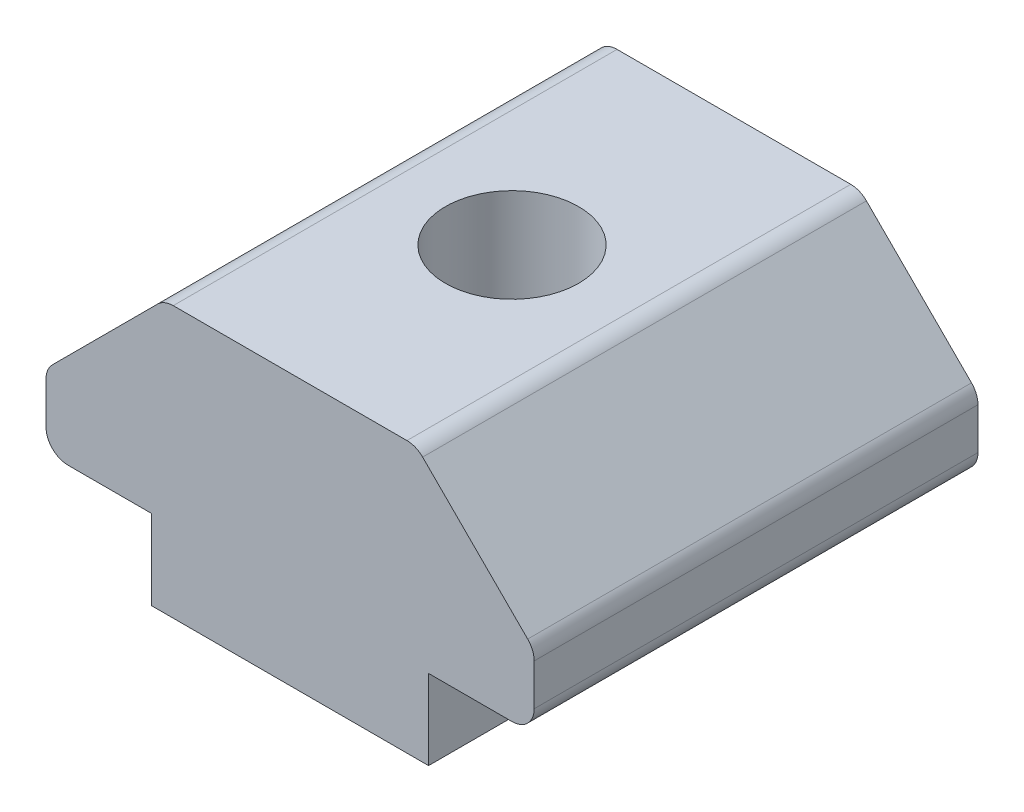
ISO-10303-21;
HEADER;
FILE_DESCRIPTION(('STEP AP214'),'2;1');
FILE_NAME('part.step','',(''),(''),'','','');
FILE_SCHEMA(('AUTOMOTIVE_DESIGN { 1 0 10303 214 1 1 1 1 }'));
ENDSEC;
DATA;
#1=APPLICATION_CONTEXT('core data for automotive mechanical design processes');
#2=APPLICATION_PROTOCOL_DEFINITION('international standard','automotive_design',2000,#1);
#3=PRODUCT_CONTEXT('',#1,'mechanical');
#4=PRODUCT('Part','Part','',(#3));
#5=PRODUCT_RELATED_PRODUCT_CATEGORY('part','',(#4));
#6=PRODUCT_DEFINITION_FORMATION('','',#4);
#7=PRODUCT_DEFINITION_CONTEXT('part definition',#1,'design');
#8=PRODUCT_DEFINITION('design','',#6,#7);
#9=PRODUCT_DEFINITION_SHAPE('','',#8);
#10=(LENGTH_UNIT() NAMED_UNIT(*) SI_UNIT(.MILLI.,.METRE.));
#11=(NAMED_UNIT(*) PLANE_ANGLE_UNIT() SI_UNIT($,.RADIAN.));
#12=(NAMED_UNIT(*) SI_UNIT($,.STERADIAN.) SOLID_ANGLE_UNIT());
#13=UNCERTAINTY_MEASURE_WITH_UNIT(LENGTH_MEASURE(1.E-05),#10,'distance_accuracy_value','');
#14=(GEOMETRIC_REPRESENTATION_CONTEXT(3) GLOBAL_UNCERTAINTY_ASSIGNED_CONTEXT((#13)) GLOBAL_UNIT_ASSIGNED_CONTEXT((#10,
#11,#12)) REPRESENTATION_CONTEXT('',''));
#15=CARTESIAN_POINT('',(0.,0.,0.));
#16=DIRECTION('',(0.,0.,1.));
#17=DIRECTION('',(1.,0.,0.));
#18=AXIS2_PLACEMENT_3D('',#15,#16,#17);
#19=CARTESIAN_POINT('',(-15.5,1.79933982822017,10.));
#20=DIRECTION('',(0.,1.,0.));
#21=DIRECTION('',(-1.,0.,0.));
#22=AXIS2_PLACEMENT_3D('',#19,#20,#21);
#23=PLANE('',#22);
#24=DIRECTION('',(1.,0.,0.));
#25=VECTOR('',#24,1.);
#26=CARTESIAN_POINT('',(-15.5,1.79933982822017,0.));
#27=LINE('',#26,#25);
#28=CARTESIAN_POINT('',(-15.,1.79933982822017,0.));
#29=VERTEX_POINT('',#28);
#30=CARTESIAN_POINT('',(-13.12,1.79933982822017,0.));
#31=VERTEX_POINT('',#30);
#32=EDGE_CURVE('E207',#29,#31,#27,.T.);
#33=ORIENTED_EDGE('',*,*,#32,.T.);
#34=DIRECTION('',(0.,0.,1.));
#35=VECTOR('',#34,1.);
#36=CARTESIAN_POINT('',(-13.12,1.79933982822017,0.));
#37=LINE('',#36,#35);
#38=CARTESIAN_POINT('',(-13.12,1.79933982822017,10.));
#39=VERTEX_POINT('',#38);
#40=EDGE_CURVE('E58',#31,#39,#37,.T.);
#41=ORIENTED_EDGE('',*,*,#40,.T.);
#42=DIRECTION('',(1.,0.,0.));
#43=VECTOR('',#42,1.);
#44=CARTESIAN_POINT('',(-15.5,1.79933982822017,10.));
#45=LINE('',#44,#43);
#46=CARTESIAN_POINT('',(-15.,1.79933982822017,10.));
#47=VERTEX_POINT('',#46);
#48=EDGE_CURVE('E190',#47,#39,#45,.T.);
#49=ORIENTED_EDGE('',*,*,#48,.F.);
#50=DIRECTION('',(0.,0.,-1.));
#51=VECTOR('',#50,1.);
#52=CARTESIAN_POINT('',(-15.,1.79933982822017,10.));
#53=LINE('',#52,#51);
#54=EDGE_CURVE('E206',#47,#29,#53,.T.);
#55=ORIENTED_EDGE('',*,*,#54,.T.);
#56=EDGE_LOOP('',(#33,#41,#49,#55));
#57=FACE_BOUND('',#56,.T.);
#58=ADVANCED_FACE('F36',(#57),#23,.F.);
#59=CARTESIAN_POINT('',(-6.88,1.79933982822017,10.));
#60=VERTEX_POINT('',#59);
#61=CARTESIAN_POINT('',(-5.,1.79933982822017,10.));
#62=VERTEX_POINT('',#61);
#63=EDGE_CURVE('E50',#60,#62,#45,.T.);
#64=ORIENTED_EDGE('',*,*,#63,.F.);
#65=DIRECTION('',(0.,0.,1.));
#66=VECTOR('',#65,1.);
#67=CARTESIAN_POINT('',(-6.88,1.79933982822017,0.));
#68=LINE('',#67,#66);
#69=CARTESIAN_POINT('',(-6.88,1.79933982822017,0.));
#70=VERTEX_POINT('',#69);
#71=EDGE_CURVE('E160',#70,#60,#68,.T.);
#72=ORIENTED_EDGE('',*,*,#71,.F.);
#73=CARTESIAN_POINT('',(-5.,1.79933982822017,0.));
#74=VERTEX_POINT('',#73);
#75=EDGE_CURVE('E171',#70,#74,#27,.T.);
#76=ORIENTED_EDGE('',*,*,#75,.T.);
#77=DIRECTION('',(0.,0.,-1.));
#78=VECTOR('',#77,1.);
#79=CARTESIAN_POINT('',(-5.,1.79933982822017,10.));
#80=LINE('',#79,#78);
#81=EDGE_CURVE('E12',#74,#62,#80,.F.);
#82=ORIENTED_EDGE('',*,*,#81,.T.);
#83=EDGE_LOOP('',(#64,#72,#76,#82));
#84=FACE_BOUND('',#83,.T.);
#85=ADVANCED_FACE('F326',(#84),#23,.F.);
#86=CARTESIAN_POINT('',(-4.5,1.79933982822017,10.));
#87=DIRECTION('',(-1.,0.,0.));
#88=DIRECTION('',(0.,-1.,0.));
#89=AXIS2_PLACEMENT_3D('',#86,#87,#88);
#90=PLANE('',#89);
#91=DIRECTION('',(0.,1.,0.));
#92=VECTOR('',#91,1.);
#93=CARTESIAN_POINT('',(-4.5,1.79933982822017,0.));
#94=LINE('',#93,#92);
#95=CARTESIAN_POINT('',(-4.5,2.29933982822017,0.));
#96=VERTEX_POINT('',#95);
#97=CARTESIAN_POINT('',(-4.5,3.23223304703362,0.));
#98=VERTEX_POINT('',#97);
#99=EDGE_CURVE('E209',#96,#98,#94,.T.);
#100=ORIENTED_EDGE('',*,*,#99,.T.);
#101=DIRECTION('',(0.,0.,-1.));
#102=VECTOR('',#101,1.);
#103=CARTESIAN_POINT('',(-4.5,3.23223304703362,10.));
#104=LINE('',#103,#102);
#105=CARTESIAN_POINT('',(-4.5,3.23223304703362,10.));
#106=VERTEX_POINT('',#105);
#107=EDGE_CURVE('E44',#98,#106,#104,.F.);
#108=ORIENTED_EDGE('',*,*,#107,.T.);
#109=DIRECTION('',(0.,1.,0.));
#110=VECTOR('',#109,1.);
#111=CARTESIAN_POINT('',(-4.5,1.79933982822017,10.));
#112=LINE('',#111,#110);
#113=CARTESIAN_POINT('',(-4.5,2.29933982822017,10.));
#114=VERTEX_POINT('',#113);
#115=EDGE_CURVE('E192',#114,#106,#112,.T.);
#116=ORIENTED_EDGE('',*,*,#115,.F.);
#117=DIRECTION('',(0.,0.,-1.));
#118=VECTOR('',#117,1.);
#119=CARTESIAN_POINT('',(-4.5,2.29933982822017,10.));
#120=LINE('',#119,#118);
#121=EDGE_CURVE('E271',#114,#96,#120,.T.);
#122=ORIENTED_EDGE('',*,*,#121,.T.);
#123=EDGE_LOOP('',(#100,#108,#116,#122));
#124=FACE_BOUND('',#123,.T.);
#125=ADVANCED_FACE('F276',(#124),#90,.F.);
#126=CARTESIAN_POINT('',(-4.5,3.43933982822017,10.));
#127=DIRECTION('',(-0.707106781186547,-0.707106781186548,0.));
#128=DIRECTION('',(0.707106781186548,-0.707106781186547,0.));
#129=AXIS2_PLACEMENT_3D('',#126,#127,#128);
#130=PLANE('',#129);
#131=DIRECTION('',(-0.707106781186548,0.707106781186547,0.));
#132=VECTOR('',#131,1.);
#133=CARTESIAN_POINT('',(-4.5,3.43933982822017,0.));
#134=LINE('',#133,#132);
#135=CARTESIAN_POINT('',(-4.64644660940673,3.5857864376269,0.));
#136=VERTEX_POINT('',#135);
#137=CARTESIAN_POINT('',(-7.01355339059328,5.95289321881345,0.));
#138=VERTEX_POINT('',#137);
#139=EDGE_CURVE('E212',#136,#138,#134,.T.);
#140=ORIENTED_EDGE('',*,*,#139,.T.);
#141=DIRECTION('',(0.,0.,-1.));
#142=VECTOR('',#141,1.);
#143=CARTESIAN_POINT('',(-7.01355339059328,5.95289321881344,10.));
#144=LINE('',#143,#142);
#145=CARTESIAN_POINT('',(-7.01355339059328,5.95289321881345,10.));
#146=VERTEX_POINT('',#145);
#147=EDGE_CURVE('E269',#138,#146,#144,.F.);
#148=ORIENTED_EDGE('',*,*,#147,.T.);
#149=DIRECTION('',(-0.707106781186548,0.707106781186547,0.));
#150=VECTOR('',#149,1.);
#151=CARTESIAN_POINT('',(-4.5,3.43933982822017,10.));
#152=LINE('',#151,#150);
#153=CARTESIAN_POINT('',(-4.64644660940673,3.5857864376269,10.));
#154=VERTEX_POINT('',#153);
#155=EDGE_CURVE('E195',#154,#146,#152,.T.);
#156=ORIENTED_EDGE('',*,*,#155,.F.);
#157=DIRECTION('',(0.,0.,-1.));
#158=VECTOR('',#157,1.);
#159=CARTESIAN_POINT('',(-4.64644660940673,3.5857864376269,10.));
#160=LINE('',#159,#158);
#161=EDGE_CURVE('E266',#154,#136,#160,.T.);
#162=ORIENTED_EDGE('',*,*,#161,.T.);
#163=EDGE_LOOP('',(#140,#148,#156,#162));
#164=FACE_BOUND('',#163,.T.);
#165=ADVANCED_FACE('F289',(#164),#130,.F.);
#166=CARTESIAN_POINT('',(-9.75,6.09933982822017,10.));
#167=DIRECTION('',(0.,-1.,0.));
#168=DIRECTION('',(0.,0.,-1.));
#169=AXIS2_PLACEMENT_3D('',#166,#167,#168);
#170=PLANE('',#169);
#171=CARTESIAN_POINT('',(-10.,6.09933982822018,5.));
#172=DIRECTION('',(0.,-1.,0.));
#173=DIRECTION('',(1.,0.,0.));
#174=AXIS2_PLACEMENT_3D('',#171,#172,#173);
#175=CIRCLE('',#174,1.5);
#176=CARTESIAN_POINT('',(-8.5,6.09933982822018,5.));
#177=VERTEX_POINT('',#176);
#178=EDGE_CURVE('E180',#177,#177,#175,.T.);
#179=ORIENTED_EDGE('',*,*,#178,.T.);
#180=EDGE_LOOP('',(#179));
#181=FACE_BOUND('',#180,.T.);
#182=DIRECTION('',(-1.,0.,0.));
#183=VECTOR('',#182,1.);
#184=CARTESIAN_POINT('',(-9.75,6.09933982822017,0.));
#185=LINE('',#184,#183);
#186=CARTESIAN_POINT('',(-7.36710678118655,6.09933982822017,0.));
#187=VERTEX_POINT('',#186);
#188=CARTESIAN_POINT('',(-12.6328932188135,6.09933982822017,0.));
#189=VERTEX_POINT('',#188);
#190=EDGE_CURVE('E215',#187,#189,#185,.T.);
#191=ORIENTED_EDGE('',*,*,#190,.T.);
#192=DIRECTION('',(0.,0.,-1.));
#193=VECTOR('',#192,1.);
#194=CARTESIAN_POINT('',(-12.6328932188135,6.09933982822017,10.));
#195=LINE('',#194,#193);
#196=CARTESIAN_POINT('',(-12.6328932188135,6.09933982822018,10.));
#197=VERTEX_POINT('',#196);
#198=EDGE_CURVE('E264',#189,#197,#195,.F.);
#199=ORIENTED_EDGE('',*,*,#198,.T.);
#200=DIRECTION('',(-1.,0.,0.));
#201=VECTOR('',#200,1.);
#202=CARTESIAN_POINT('',(-7.16,6.09933982822017,10.));
#203=LINE('',#202,#201);
#204=CARTESIAN_POINT('',(-7.36710678118655,6.09933982822017,10.));
#205=VERTEX_POINT('',#204);
#206=EDGE_CURVE('E198',#205,#197,#203,.T.);
#207=ORIENTED_EDGE('',*,*,#206,.F.);
#208=DIRECTION('',(0.,0.,-1.));
#209=VECTOR('',#208,1.);
#210=CARTESIAN_POINT('',(-7.36710678118655,6.09933982822017,10.));
#211=LINE('',#210,#209);
#212=EDGE_CURVE('E261',#205,#187,#211,.T.);
#213=ORIENTED_EDGE('',*,*,#212,.T.);
#214=EDGE_LOOP('',(#191,#199,#207,#213));
#215=FACE_BOUND('',#214,.T.);
#216=ADVANCED_FACE('F298',(#181,#215),#170,.F.);
#217=CARTESIAN_POINT('',(-12.84,6.09933982822017,10.));
#218=DIRECTION('',(0.707106781186547,-0.707106781186548,0.));
#219=DIRECTION('',(0.707106781186548,0.707106781186547,0.));
#220=AXIS2_PLACEMENT_3D('',#217,#218,#219);
#221=PLANE('',#220);
#222=DIRECTION('',(-0.707106781186548,-0.707106781186547,0.));
#223=VECTOR('',#222,1.);
#224=CARTESIAN_POINT('',(-12.84,6.09933982822017,0.));
#225=LINE('',#224,#223);
#226=CARTESIAN_POINT('',(-12.9864466094067,5.95289321881344,0.));
#227=VERTEX_POINT('',#226);
#228=CARTESIAN_POINT('',(-15.3535533905933,3.5857864376269,0.));
#229=VERTEX_POINT('',#228);
#230=EDGE_CURVE('E218',#227,#229,#225,.T.);
#231=ORIENTED_EDGE('',*,*,#230,.T.);
#232=DIRECTION('',(0.,0.,-1.));
#233=VECTOR('',#232,1.);
#234=CARTESIAN_POINT('',(-15.3535533905933,3.5857864376269,10.));
#235=LINE('',#234,#233);
#236=CARTESIAN_POINT('',(-15.3535533905933,3.5857864376269,10.));
#237=VERTEX_POINT('',#236);
#238=EDGE_CURVE('E249',#229,#237,#235,.F.);
#239=ORIENTED_EDGE('',*,*,#238,.T.);
#240=DIRECTION('',(-0.707106781186548,-0.707106781186547,0.));
#241=VECTOR('',#240,1.);
#242=CARTESIAN_POINT('',(-12.84,6.09933982822017,10.));
#243=LINE('',#242,#241);
#244=CARTESIAN_POINT('',(-12.9864466094067,5.95289321881344,10.));
#245=VERTEX_POINT('',#244);
#246=EDGE_CURVE('E201',#245,#237,#243,.T.);
#247=ORIENTED_EDGE('',*,*,#246,.F.);
#248=DIRECTION('',(0.,0.,-1.));
#249=VECTOR('',#248,1.);
#250=CARTESIAN_POINT('',(-12.9864466094067,5.95289321881344,10.));
#251=LINE('',#250,#249);
#252=EDGE_CURVE('E246',#245,#227,#251,.T.);
#253=ORIENTED_EDGE('',*,*,#252,.T.);
#254=EDGE_LOOP('',(#231,#239,#247,#253));
#255=FACE_BOUND('',#254,.T.);
#256=ADVANCED_FACE('F307',(#255),#221,.F.);
#257=CARTESIAN_POINT('',(-15.5,3.43933982822018,10.));
#258=DIRECTION('',(1.,0.,0.));
#259=DIRECTION('',(0.,0.,-1.));
#260=AXIS2_PLACEMENT_3D('',#257,#258,#259);
#261=PLANE('',#260);
#262=DIRECTION('',(0.,-1.,0.));
#263=VECTOR('',#262,1.);
#264=CARTESIAN_POINT('',(-15.5,3.43933982822018,10.));
#265=LINE('',#264,#263);
#266=CARTESIAN_POINT('',(-15.5,3.23223304703363,10.));
#267=VERTEX_POINT('',#266);
#268=CARTESIAN_POINT('',(-15.5,2.29933982822017,10.));
#269=VERTEX_POINT('',#268);
#270=EDGE_CURVE('E204',#267,#269,#265,.T.);
#271=ORIENTED_EDGE('',*,*,#270,.F.);
#272=DIRECTION('',(0.,0.,-1.));
#273=VECTOR('',#272,1.);
#274=CARTESIAN_POINT('',(-15.5,3.23223304703363,10.));
#275=LINE('',#274,#273);
#276=CARTESIAN_POINT('',(-15.5,3.23223304703363,0.));
#277=VERTEX_POINT('',#276);
#278=EDGE_CURVE('E233',#267,#277,#275,.T.);
#279=ORIENTED_EDGE('',*,*,#278,.T.);
#280=DIRECTION('',(0.,-1.,0.));
#281=VECTOR('',#280,1.);
#282=CARTESIAN_POINT('',(-15.5,3.43933982822018,0.));
#283=LINE('',#282,#281);
#284=CARTESIAN_POINT('',(-15.5,2.29933982822017,0.));
#285=VERTEX_POINT('',#284);
#286=EDGE_CURVE('E221',#277,#285,#283,.T.);
#287=ORIENTED_EDGE('',*,*,#286,.T.);
#288=DIRECTION('',(0.,0.,-1.));
#289=VECTOR('',#288,1.);
#290=CARTESIAN_POINT('',(-15.5,2.29933982822017,10.));
#291=LINE('',#290,#289);
#292=EDGE_CURVE('E228',#285,#269,#291,.F.);
#293=ORIENTED_EDGE('',*,*,#292,.T.);
#294=EDGE_LOOP('',(#271,#279,#287,#293));
#295=FACE_BOUND('',#294,.T.);
#296=ADVANCED_FACE('F315',(#295),#261,.F.);
#297=CARTESIAN_POINT('',(0.,0.,10.));
#298=DIRECTION('',(0.,0.,1.));
#299=DIRECTION('',(1.,0.,0.));
#300=AXIS2_PLACEMENT_3D('',#297,#298,#299);
#301=PLANE('',#300);
#302=ORIENTED_EDGE('',*,*,#246,.T.);
#303=CARTESIAN_POINT('',(-15.,3.23223304703363,10.));
#304=DIRECTION('',(0.,0.,1.));
#305=DIRECTION('',(1.,0.,0.));
#306=AXIS2_PLACEMENT_3D('',#303,#304,#305);
#307=CIRCLE('',#306,0.5);
#308=EDGE_CURVE('E259',#237,#267,#307,.T.);
#309=ORIENTED_EDGE('',*,*,#308,.T.);
#310=ORIENTED_EDGE('',*,*,#270,.T.);
#311=CARTESIAN_POINT('',(-15.,2.29933982822017,10.));
#312=DIRECTION('',(0.,0.,1.));
#313=DIRECTION('',(1.,0.,0.));
#314=AXIS2_PLACEMENT_3D('',#311,#312,#313);
#315=CIRCLE('',#314,0.5);
#316=EDGE_CURVE('E231',#269,#47,#315,.T.);
#317=ORIENTED_EDGE('',*,*,#316,.T.);
#318=ORIENTED_EDGE('',*,*,#48,.T.);
#319=DIRECTION('',(0.,-1.,0.));
#320=VECTOR('',#319,1.);
#321=CARTESIAN_POINT('',(-13.12,1.79933982822017,10.));
#322=LINE('',#321,#320);
#323=CARTESIAN_POINT('',(-13.12,-0.000660171779829927,10.));
#324=VERTEX_POINT('',#323);
#325=EDGE_CURVE('E175',#39,#324,#322,.T.);
#326=ORIENTED_EDGE('',*,*,#325,.T.);
#327=DIRECTION('',(1.,0.,0.));
#328=VECTOR('',#327,1.);
#329=CARTESIAN_POINT('',(-13.12,-0.000660171779829927,10.));
#330=LINE('',#329,#328);
#331=CARTESIAN_POINT('',(-6.88,-0.000660171779829927,10.));
#332=VERTEX_POINT('',#331);
#333=EDGE_CURVE('E184',#324,#332,#330,.T.);
#334=ORIENTED_EDGE('',*,*,#333,.T.);
#335=DIRECTION('',(0.,1.,0.));
#336=VECTOR('',#335,1.);
#337=CARTESIAN_POINT('',(-6.88,-0.000660171779829927,10.));
#338=LINE('',#337,#336);
#339=EDGE_CURVE('E155',#332,#60,#338,.T.);
#340=ORIENTED_EDGE('',*,*,#339,.T.);
#341=ORIENTED_EDGE('',*,*,#63,.T.);
#342=CARTESIAN_POINT('',(-5.,2.29933982822017,10.));
#343=DIRECTION('',(0.,0.,1.));
#344=DIRECTION('',(1.,0.,0.));
#345=AXIS2_PLACEMENT_3D('',#342,#343,#344);
#346=CIRCLE('',#345,0.5);
#347=EDGE_CURVE('E251',#62,#114,#346,.T.);
#348=ORIENTED_EDGE('',*,*,#347,.T.);
#349=ORIENTED_EDGE('',*,*,#115,.T.);
#350=CARTESIAN_POINT('',(-5.,3.23223304703362,10.));
#351=DIRECTION('',(0.,0.,1.));
#352=DIRECTION('',(1.,0.,0.));
#353=AXIS2_PLACEMENT_3D('',#350,#351,#352);
#354=CIRCLE('',#353,0.5);
#355=EDGE_CURVE('E253',#106,#154,#354,.T.);
#356=ORIENTED_EDGE('',*,*,#355,.T.);
#357=ORIENTED_EDGE('',*,*,#155,.T.);
#358=CARTESIAN_POINT('',(-7.36710678118655,5.59933982822017,10.));
#359=DIRECTION('',(0.,0.,1.));
#360=DIRECTION('',(1.,0.,0.));
#361=AXIS2_PLACEMENT_3D('',#358,#359,#360);
#362=CIRCLE('',#361,0.5);
#363=EDGE_CURVE('E255',#146,#205,#362,.T.);
#364=ORIENTED_EDGE('',*,*,#363,.T.);
#365=ORIENTED_EDGE('',*,*,#206,.T.);
#366=CARTESIAN_POINT('',(-12.6328932188135,5.59933982822017,10.));
#367=DIRECTION('',(0.,0.,1.));
#368=DIRECTION('',(1.,0.,0.));
#369=AXIS2_PLACEMENT_3D('',#366,#367,#368);
#370=CIRCLE('',#369,0.5);
#371=EDGE_CURVE('E257',#197,#245,#370,.T.);
#372=ORIENTED_EDGE('',*,*,#371,.T.);
#373=EDGE_LOOP('',(#302,#309,#310,#317,#318,#326,#334,#340,#341,#348,#349,#356,#357,#364,#365,#372));
#374=FACE_BOUND('',#373,.T.);
#375=ADVANCED_FACE('F282',(#374),#301,.T.);
#376=CARTESIAN_POINT('',(0.,0.,0.));
#377=DIRECTION('',(0.,0.,1.));
#378=DIRECTION('',(1.,0.,0.));
#379=AXIS2_PLACEMENT_3D('',#376,#377,#378);
#380=PLANE('',#379);
#381=ORIENTED_EDGE('',*,*,#286,.F.);
#382=CARTESIAN_POINT('',(-15.,3.23223304703363,0.));
#383=DIRECTION('',(0.,0.,1.));
#384=DIRECTION('',(1.,0.,0.));
#385=AXIS2_PLACEMENT_3D('',#382,#383,#384);
#386=CIRCLE('',#385,0.5);
#387=EDGE_CURVE('E244',#277,#229,#386,.F.);
#388=ORIENTED_EDGE('',*,*,#387,.T.);
#389=ORIENTED_EDGE('',*,*,#230,.F.);
#390=CARTESIAN_POINT('',(-12.6328932188135,5.59933982822017,0.));
#391=DIRECTION('',(0.,0.,1.));
#392=DIRECTION('',(1.,0.,0.));
#393=AXIS2_PLACEMENT_3D('',#390,#391,#392);
#394=CIRCLE('',#393,0.5);
#395=EDGE_CURVE('E242',#227,#189,#394,.F.);
#396=ORIENTED_EDGE('',*,*,#395,.T.);
#397=ORIENTED_EDGE('',*,*,#190,.F.);
#398=CARTESIAN_POINT('',(-7.36710678118655,5.59933982822017,0.));
#399=DIRECTION('',(0.,0.,1.));
#400=DIRECTION('',(1.,0.,0.));
#401=AXIS2_PLACEMENT_3D('',#398,#399,#400);
#402=CIRCLE('',#401,0.5);
#403=EDGE_CURVE('E240',#187,#138,#402,.F.);
#404=ORIENTED_EDGE('',*,*,#403,.T.);
#405=ORIENTED_EDGE('',*,*,#139,.F.);
#406=CARTESIAN_POINT('',(-5.,3.23223304703362,0.));
#407=DIRECTION('',(0.,0.,1.));
#408=DIRECTION('',(1.,0.,0.));
#409=AXIS2_PLACEMENT_3D('',#406,#407,#408);
#410=CIRCLE('',#409,0.5);
#411=EDGE_CURVE('E238',#136,#98,#410,.F.);
#412=ORIENTED_EDGE('',*,*,#411,.T.);
#413=ORIENTED_EDGE('',*,*,#99,.F.);
#414=CARTESIAN_POINT('',(-5.,2.29933982822017,0.));
#415=DIRECTION('',(0.,0.,1.));
#416=DIRECTION('',(1.,0.,0.));
#417=AXIS2_PLACEMENT_3D('',#414,#415,#416);
#418=CIRCLE('',#417,0.5);
#419=EDGE_CURVE('E236',#96,#74,#418,.F.);
#420=ORIENTED_EDGE('',*,*,#419,.T.);
#421=ORIENTED_EDGE('',*,*,#75,.F.);
#422=DIRECTION('',(0.,1.,0.));
#423=VECTOR('',#422,1.);
#424=CARTESIAN_POINT('',(-6.88,-0.000660171779829927,0.));
#425=LINE('',#424,#423);
#426=CARTESIAN_POINT('',(-6.88,-0.000660171779829927,0.));
#427=VERTEX_POINT('',#426);
#428=EDGE_CURVE('E153',#427,#70,#425,.T.);
#429=ORIENTED_EDGE('',*,*,#428,.F.);
#430=DIRECTION('',(1.,0.,0.));
#431=VECTOR('',#430,1.);
#432=CARTESIAN_POINT('',(-13.12,-0.000660171779829927,0.));
#433=LINE('',#432,#431);
#434=CARTESIAN_POINT('',(-13.12,-0.000660171779829927,0.));
#435=VERTEX_POINT('',#434);
#436=EDGE_CURVE('E168',#435,#427,#433,.T.);
#437=ORIENTED_EDGE('',*,*,#436,.F.);
#438=DIRECTION('',(0.,-1.,0.));
#439=VECTOR('',#438,1.);
#440=CARTESIAN_POINT('',(-13.12,1.79933982822017,0.));
#441=LINE('',#440,#439);
#442=EDGE_CURVE('E161',#31,#435,#441,.T.);
#443=ORIENTED_EDGE('',*,*,#442,.F.);
#444=ORIENTED_EDGE('',*,*,#32,.F.);
#445=CARTESIAN_POINT('',(-15.,2.29933982822017,0.));
#446=DIRECTION('',(0.,0.,1.));
#447=DIRECTION('',(1.,0.,0.));
#448=AXIS2_PLACEMENT_3D('',#445,#446,#447);
#449=CIRCLE('',#448,0.5);
#450=EDGE_CURVE('E225',#29,#285,#449,.F.);
#451=ORIENTED_EDGE('',*,*,#450,.T.);
#452=EDGE_LOOP('',(#381,#388,#389,#396,#397,#404,#405,#412,#413,#420,#421,#429,#437,#443,#444,#451));
#453=FACE_BOUND('',#452,.T.);
#454=ADVANCED_FACE('F166',(#453),#380,.F.);
#455=CARTESIAN_POINT('',(-15.,2.29933982822017,10.));
#456=DIRECTION('',(0.,0.,-1.));
#457=DIRECTION('',(-1.,0.,0.));
#458=AXIS2_PLACEMENT_3D('',#455,#456,#457);
#459=CYLINDRICAL_SURFACE('',#458,0.5);
#460=ORIENTED_EDGE('',*,*,#316,.F.);
#461=ORIENTED_EDGE('',*,*,#292,.F.);
#462=ORIENTED_EDGE('',*,*,#450,.F.);
#463=ORIENTED_EDGE('',*,*,#54,.F.);
#464=EDGE_LOOP('',(#460,#461,#462,#463));
#465=FACE_BOUND('',#464,.T.);
#466=ADVANCED_FACE('F322',(#465),#459,.T.);
#467=CARTESIAN_POINT('',(-15.,3.23223304703363,10.));
#468=DIRECTION('',(0.,0.,-1.));
#469=DIRECTION('',(-1.,0.,0.));
#470=AXIS2_PLACEMENT_3D('',#467,#468,#469);
#471=CYLINDRICAL_SURFACE('',#470,0.5);
#472=ORIENTED_EDGE('',*,*,#308,.F.);
#473=ORIENTED_EDGE('',*,*,#238,.F.);
#474=ORIENTED_EDGE('',*,*,#387,.F.);
#475=ORIENTED_EDGE('',*,*,#278,.F.);
#476=EDGE_LOOP('',(#472,#473,#474,#475));
#477=FACE_BOUND('',#476,.T.);
#478=ADVANCED_FACE('F312',(#477),#471,.T.);
#479=CARTESIAN_POINT('',(-12.6328932188135,5.59933982822017,10.));
#480=DIRECTION('',(0.,0.,-1.));
#481=DIRECTION('',(-1.,0.,0.));
#482=AXIS2_PLACEMENT_3D('',#479,#480,#481);
#483=CYLINDRICAL_SURFACE('',#482,0.5);
#484=ORIENTED_EDGE('',*,*,#371,.F.);
#485=ORIENTED_EDGE('',*,*,#198,.F.);
#486=ORIENTED_EDGE('',*,*,#395,.F.);
#487=ORIENTED_EDGE('',*,*,#252,.F.);
#488=EDGE_LOOP('',(#484,#485,#486,#487));
#489=FACE_BOUND('',#488,.T.);
#490=ADVANCED_FACE('F304',(#489),#483,.T.);
#491=CARTESIAN_POINT('',(-7.36710678118655,5.59933982822017,10.));
#492=DIRECTION('',(0.,0.,-1.));
#493=DIRECTION('',(-1.,0.,0.));
#494=AXIS2_PLACEMENT_3D('',#491,#492,#493);
#495=CYLINDRICAL_SURFACE('',#494,0.5);
#496=ORIENTED_EDGE('',*,*,#363,.F.);
#497=ORIENTED_EDGE('',*,*,#147,.F.);
#498=ORIENTED_EDGE('',*,*,#403,.F.);
#499=ORIENTED_EDGE('',*,*,#212,.F.);
#500=EDGE_LOOP('',(#496,#497,#498,#499));
#501=FACE_BOUND('',#500,.T.);
#502=ADVANCED_FACE('F295',(#501),#495,.T.);
#503=CARTESIAN_POINT('',(-5.,3.23223304703362,10.));
#504=DIRECTION('',(0.,0.,-1.));
#505=DIRECTION('',(-1.,0.,0.));
#506=AXIS2_PLACEMENT_3D('',#503,#504,#505);
#507=CYLINDRICAL_SURFACE('',#506,0.5);
#508=ORIENTED_EDGE('',*,*,#355,.F.);
#509=ORIENTED_EDGE('',*,*,#107,.F.);
#510=ORIENTED_EDGE('',*,*,#411,.F.);
#511=ORIENTED_EDGE('',*,*,#161,.F.);
#512=EDGE_LOOP('',(#508,#509,#510,#511));
#513=FACE_BOUND('',#512,.T.);
#514=ADVANCED_FACE('F286',(#513),#507,.T.);
#515=CARTESIAN_POINT('',(-5.,2.29933982822017,10.));
#516=DIRECTION('',(0.,0.,-1.));
#517=DIRECTION('',(-1.,0.,0.));
#518=AXIS2_PLACEMENT_3D('',#515,#516,#517);
#519=CYLINDRICAL_SURFACE('',#518,0.5);
#520=ORIENTED_EDGE('',*,*,#347,.F.);
#521=ORIENTED_EDGE('',*,*,#81,.F.);
#522=ORIENTED_EDGE('',*,*,#419,.F.);
#523=ORIENTED_EDGE('',*,*,#121,.F.);
#524=EDGE_LOOP('',(#520,#521,#522,#523));
#525=FACE_BOUND('',#524,.T.);
#526=ADVANCED_FACE('F38',(#525),#519,.T.);
#527=CARTESIAN_POINT('',(-13.12,-0.000660171779829927,0.));
#528=DIRECTION('',(0.,-1.,0.));
#529=DIRECTION('',(0.,0.,-1.));
#530=AXIS2_PLACEMENT_3D('',#527,#528,#529);
#531=PLANE('',#530);
#532=CARTESIAN_POINT('',(-10.,-0.000660171779830795,5.));
#533=DIRECTION('',(0.,-1.,0.));
#534=DIRECTION('',(1.,0.,0.));
#535=AXIS2_PLACEMENT_3D('',#532,#533,#534);
#536=CIRCLE('',#535,1.5);
#537=CARTESIAN_POINT('',(-8.5,-0.000660171779830588,5.));
#538=VERTEX_POINT('',#537);
#539=EDGE_CURVE('E495',#538,#538,#536,.T.);
#540=ORIENTED_EDGE('',*,*,#539,.F.);
#541=EDGE_LOOP('',(#540));
#542=FACE_BOUND('',#541,.T.);
#543=ORIENTED_EDGE('',*,*,#333,.F.);
#544=DIRECTION('',(0.,0.,1.));
#545=VECTOR('',#544,1.);
#546=CARTESIAN_POINT('',(-13.12,-0.000660171779829927,0.));
#547=LINE('',#546,#545);
#548=EDGE_CURVE('E174',#435,#324,#547,.T.);
#549=ORIENTED_EDGE('',*,*,#548,.F.);
#550=ORIENTED_EDGE('',*,*,#436,.T.);
#551=DIRECTION('',(0.,0.,1.));
#552=VECTOR('',#551,1.);
#553=CARTESIAN_POINT('',(-6.88,-0.000660171779829927,0.));
#554=LINE('',#553,#552);
#555=EDGE_CURVE('E150',#427,#332,#554,.T.);
#556=ORIENTED_EDGE('',*,*,#555,.T.);
#557=EDGE_LOOP('',(#543,#549,#550,#556));
#558=FACE_BOUND('',#557,.T.);
#559=ADVANCED_FACE('F173',(#542,#558),#531,.T.);
#560=CARTESIAN_POINT('',(-13.12,1.79933982822017,0.));
#561=DIRECTION('',(-1.,0.,0.));
#562=DIRECTION('',(0.,0.,1.));
#563=AXIS2_PLACEMENT_3D('',#560,#561,#562);
#564=PLANE('',#563);
#565=ORIENTED_EDGE('',*,*,#325,.F.);
#566=ORIENTED_EDGE('',*,*,#40,.F.);
#567=ORIENTED_EDGE('',*,*,#442,.T.);
#568=ORIENTED_EDGE('',*,*,#548,.T.);
#569=EDGE_LOOP('',(#565,#566,#567,#568));
#570=FACE_BOUND('',#569,.T.);
#571=ADVANCED_FACE('F324',(#570),#564,.T.);
#572=CARTESIAN_POINT('',(-6.88,-0.000660171779829927,0.));
#573=DIRECTION('',(1.,0.,0.));
#574=DIRECTION('',(0.,0.,-1.));
#575=AXIS2_PLACEMENT_3D('',#572,#573,#574);
#576=PLANE('',#575);
#577=ORIENTED_EDGE('',*,*,#339,.F.);
#578=ORIENTED_EDGE('',*,*,#555,.F.);
#579=ORIENTED_EDGE('',*,*,#428,.T.);
#580=ORIENTED_EDGE('',*,*,#71,.T.);
#581=EDGE_LOOP('',(#577,#578,#579,#580));
#582=FACE_BOUND('',#581,.T.);
#583=ADVANCED_FACE('F152',(#582),#576,.T.);
#584=CARTESIAN_POINT('',(-10.,6.09933982822018,5.));
#585=DIRECTION('',(0.,-1.,0.));
#586=DIRECTION('',(1.,0.,0.));
#587=AXIS2_PLACEMENT_3D('',#584,#585,#586);
#588=CYLINDRICAL_SURFACE('',#587,1.5);
#589=ORIENTED_EDGE('',*,*,#178,.F.);
#590=EDGE_LOOP('',(#589));
#591=FACE_BOUND('',#590,.T.);
#592=ORIENTED_EDGE('',*,*,#539,.T.);
#593=EDGE_LOOP('',(#592));
#594=FACE_BOUND('',#593,.T.);
#595=ADVANCED_FACE('F411',(#591,#594),#588,.F.);
#596=CLOSED_SHELL('',(#58,#85,#125,#165,#216,#256,#296,#375,#454,#466,#478,#490,#502,#514,#526,
#559,#571,#583,#595));
#597=MANIFOLD_SOLID_BREP('B2',#596);
#598=ADVANCED_BREP_SHAPE_REPRESENTATION('',(#18,#597),#14);
#599=SHAPE_DEFINITION_REPRESENTATION(#9,#598);
ENDSEC;
END-ISO-10303-21;
